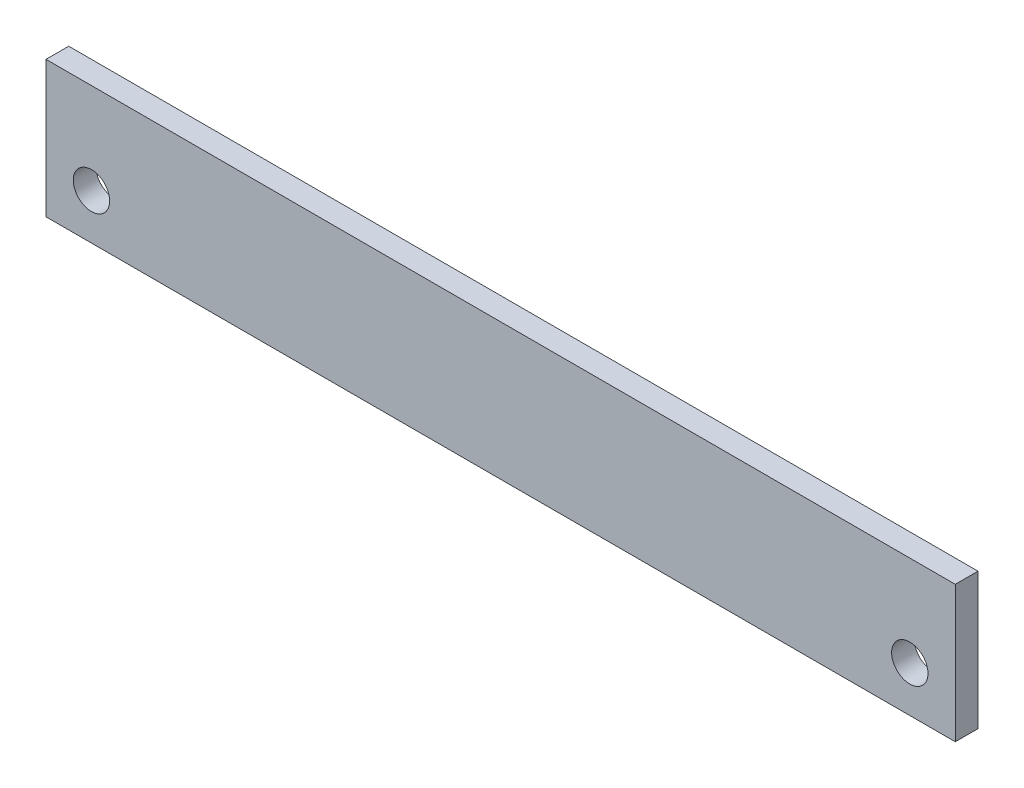
ISO-10303-21;
HEADER;
FILE_DESCRIPTION(('STEP AP214'),'2;1');
FILE_NAME('part.step','',(''),(''),'','','');
FILE_SCHEMA(('AUTOMOTIVE_DESIGN { 1 0 10303 214 1 1 1 1 }'));
ENDSEC;
DATA;
#1=APPLICATION_CONTEXT('core data for automotive mechanical design processes');
#2=APPLICATION_PROTOCOL_DEFINITION('international standard','automotive_design',2000,#1);
#3=PRODUCT_CONTEXT('',#1,'mechanical');
#4=PRODUCT('Part','Part','',(#3));
#5=PRODUCT_RELATED_PRODUCT_CATEGORY('part','',(#4));
#6=PRODUCT_DEFINITION_FORMATION('','',#4);
#7=PRODUCT_DEFINITION_CONTEXT('part definition',#1,'design');
#8=PRODUCT_DEFINITION('design','',#6,#7);
#9=PRODUCT_DEFINITION_SHAPE('','',#8);
#10=(LENGTH_UNIT() NAMED_UNIT(*) SI_UNIT(.MILLI.,.METRE.));
#11=(NAMED_UNIT(*) PLANE_ANGLE_UNIT() SI_UNIT($,.RADIAN.));
#12=(NAMED_UNIT(*) SI_UNIT($,.STERADIAN.) SOLID_ANGLE_UNIT());
#13=UNCERTAINTY_MEASURE_WITH_UNIT(LENGTH_MEASURE(1.E-05),#10,'distance_accuracy_value','');
#14=(GEOMETRIC_REPRESENTATION_CONTEXT(3) GLOBAL_UNCERTAINTY_ASSIGNED_CONTEXT((#13)) GLOBAL_UNIT_ASSIGNED_CONTEXT((#10,
#11,#12)) REPRESENTATION_CONTEXT('',''));
#15=CARTESIAN_POINT('',(0.,0.,0.));
#16=DIRECTION('',(0.,0.,1.));
#17=DIRECTION('',(1.,0.,0.));
#18=AXIS2_PLACEMENT_3D('',#15,#16,#17);
#19=CARTESIAN_POINT('',(100.,-15.,5.));
#20=DIRECTION('',(-1.,0.,0.));
#21=DIRECTION('',(0.,0.,1.));
#22=AXIS2_PLACEMENT_3D('',#19,#20,#21);
#23=PLANE('',#22);
#24=DIRECTION('',(0.,1.,0.));
#25=VECTOR('',#24,1.);
#26=CARTESIAN_POINT('',(100.,-15.,0.));
#27=LINE('',#26,#25);
#28=CARTESIAN_POINT('',(100.,-15.,0.));
#29=VERTEX_POINT('',#28);
#30=CARTESIAN_POINT('',(100.,15.,0.));
#31=VERTEX_POINT('',#30);
#32=EDGE_CURVE('E96',#29,#31,#27,.T.);
#33=ORIENTED_EDGE('',*,*,#32,.T.);
#34=DIRECTION('',(0.,0.,-1.));
#35=VECTOR('',#34,1.);
#36=CARTESIAN_POINT('',(100.,15.,5.));
#37=LINE('',#36,#35);
#38=CARTESIAN_POINT('',(100.,15.,5.));
#39=VERTEX_POINT('',#38);
#40=EDGE_CURVE('E11',#39,#31,#37,.T.);
#41=ORIENTED_EDGE('',*,*,#40,.F.);
#42=DIRECTION('',(0.,1.,0.));
#43=VECTOR('',#42,1.);
#44=CARTESIAN_POINT('',(100.,-15.,5.));
#45=LINE('',#44,#43);
#46=CARTESIAN_POINT('',(100.,-15.,5.));
#47=VERTEX_POINT('',#46);
#48=EDGE_CURVE('E84',#47,#39,#45,.T.);
#49=ORIENTED_EDGE('',*,*,#48,.F.);
#50=DIRECTION('',(0.,0.,-1.));
#51=VECTOR('',#50,1.);
#52=CARTESIAN_POINT('',(100.,-15.,5.));
#53=LINE('',#52,#51);
#54=EDGE_CURVE('E92',#47,#29,#53,.T.);
#55=ORIENTED_EDGE('',*,*,#54,.T.);
#56=EDGE_LOOP('',(#33,#41,#49,#55));
#57=FACE_BOUND('',#56,.T.);
#58=ADVANCED_FACE('F33',(#57),#23,.F.);
#59=CARTESIAN_POINT('',(-100.,15.,5.));
#60=DIRECTION('',(0.,-1.,0.));
#61=DIRECTION('',(0.,0.,-1.));
#62=AXIS2_PLACEMENT_3D('',#59,#60,#61);
#63=PLANE('',#62);
#64=DIRECTION('',(-1.,0.,0.));
#65=VECTOR('',#64,1.);
#66=CARTESIAN_POINT('',(-100.,15.,0.));
#67=LINE('',#66,#65);
#68=CARTESIAN_POINT('',(-100.,15.,0.));
#69=VERTEX_POINT('',#68);
#70=EDGE_CURVE('E88',#31,#69,#67,.T.);
#71=ORIENTED_EDGE('',*,*,#70,.T.);
#72=DIRECTION('',(0.,0.,-1.));
#73=VECTOR('',#72,1.);
#74=CARTESIAN_POINT('',(-100.,15.,5.));
#75=LINE('',#74,#73);
#76=CARTESIAN_POINT('',(-100.,15.,5.));
#77=VERTEX_POINT('',#76);
#78=EDGE_CURVE('E41',#77,#69,#75,.T.);
#79=ORIENTED_EDGE('',*,*,#78,.F.);
#80=DIRECTION('',(-1.,0.,0.));
#81=VECTOR('',#80,1.);
#82=CARTESIAN_POINT('',(-100.,15.,5.));
#83=LINE('',#82,#81);
#84=EDGE_CURVE('E79',#39,#77,#83,.T.);
#85=ORIENTED_EDGE('',*,*,#84,.F.);
#86=ORIENTED_EDGE('',*,*,#40,.T.);
#87=EDGE_LOOP('',(#71,#79,#85,#86));
#88=FACE_BOUND('',#87,.T.);
#89=ADVANCED_FACE('F87',(#88),#63,.F.);
#90=CARTESIAN_POINT('',(-100.,-15.,5.));
#91=DIRECTION('',(1.,0.,0.));
#92=DIRECTION('',(0.,0.,-1.));
#93=AXIS2_PLACEMENT_3D('',#90,#91,#92);
#94=PLANE('',#93);
#95=DIRECTION('',(0.,-1.,0.));
#96=VECTOR('',#95,1.);
#97=CARTESIAN_POINT('',(-100.,-15.,0.));
#98=LINE('',#97,#96);
#99=CARTESIAN_POINT('',(-100.,-15.,0.));
#100=VERTEX_POINT('',#99);
#101=EDGE_CURVE('E66',#69,#100,#98,.T.);
#102=ORIENTED_EDGE('',*,*,#101,.T.);
#103=DIRECTION('',(0.,0.,-1.));
#104=VECTOR('',#103,1.);
#105=CARTESIAN_POINT('',(-100.,-15.,5.));
#106=LINE('',#105,#104);
#107=CARTESIAN_POINT('',(-100.,-15.,5.));
#108=VERTEX_POINT('',#107);
#109=EDGE_CURVE('E89',#108,#100,#106,.T.);
#110=ORIENTED_EDGE('',*,*,#109,.F.);
#111=DIRECTION('',(0.,-1.,0.));
#112=VECTOR('',#111,1.);
#113=CARTESIAN_POINT('',(-100.,-15.,5.));
#114=LINE('',#113,#112);
#115=EDGE_CURVE('E82',#77,#108,#114,.T.);
#116=ORIENTED_EDGE('',*,*,#115,.F.);
#117=ORIENTED_EDGE('',*,*,#78,.T.);
#118=EDGE_LOOP('',(#102,#110,#116,#117));
#119=FACE_BOUND('',#118,.T.);
#120=ADVANCED_FACE('F90',(#119),#94,.F.);
#121=CARTESIAN_POINT('',(-100.,-15.,5.));
#122=DIRECTION('',(0.,1.,0.));
#123=DIRECTION('',(0.,0.,1.));
#124=AXIS2_PLACEMENT_3D('',#121,#122,#123);
#125=PLANE('',#124);
#126=DIRECTION('',(1.,0.,0.));
#127=VECTOR('',#126,1.);
#128=CARTESIAN_POINT('',(-100.,-15.,0.));
#129=LINE('',#128,#127);
#130=EDGE_CURVE('E72',#100,#29,#129,.T.);
#131=ORIENTED_EDGE('',*,*,#130,.T.);
#132=ORIENTED_EDGE('',*,*,#54,.F.);
#133=DIRECTION('',(1.,0.,0.));
#134=VECTOR('',#133,1.);
#135=CARTESIAN_POINT('',(-100.,-15.,5.));
#136=LINE('',#135,#134);
#137=EDGE_CURVE('E49',#108,#47,#136,.T.);
#138=ORIENTED_EDGE('',*,*,#137,.F.);
#139=ORIENTED_EDGE('',*,*,#109,.T.);
#140=EDGE_LOOP('',(#131,#132,#138,#139));
#141=FACE_BOUND('',#140,.T.);
#142=ADVANCED_FACE('F104',(#141),#125,.F.);
#143=CARTESIAN_POINT('',(0.,0.,5.));
#144=DIRECTION('',(0.,0.,-1.));
#145=DIRECTION('',(-1.,0.,0.));
#146=AXIS2_PLACEMENT_3D('',#143,#144,#145);
#147=PLANE('',#146);
#148=CARTESIAN_POINT('',(90.,-4.99999999999998,5.));
#149=DIRECTION('',(0.,0.,1.));
#150=DIRECTION('',(-1.,0.,0.));
#151=AXIS2_PLACEMENT_3D('',#148,#149,#150);
#152=CIRCLE('',#151,4.00000000000001);
#153=CARTESIAN_POINT('',(86.,-4.99999999999998,5.));
#154=VERTEX_POINT('',#153);
#155=EDGE_CURVE('E116',#154,#154,#152,.T.);
#156=ORIENTED_EDGE('',*,*,#155,.F.);
#157=EDGE_LOOP('',(#156));
#158=FACE_BOUND('',#157,.T.);
#159=CARTESIAN_POINT('',(-90.,-4.99999999999999,5.));
#160=DIRECTION('',(0.,0.,1.));
#161=DIRECTION('',(1.,0.,0.));
#162=AXIS2_PLACEMENT_3D('',#159,#160,#161);
#163=CIRCLE('',#162,4.00000000000001);
#164=CARTESIAN_POINT('',(-86.,-4.99999999999999,5.));
#165=VERTEX_POINT('',#164);
#166=EDGE_CURVE('E110',#165,#165,#163,.T.);
#167=ORIENTED_EDGE('',*,*,#166,.F.);
#168=EDGE_LOOP('',(#167));
#169=FACE_BOUND('',#168,.T.);
#170=ORIENTED_EDGE('',*,*,#48,.T.);
#171=ORIENTED_EDGE('',*,*,#84,.T.);
#172=ORIENTED_EDGE('',*,*,#115,.T.);
#173=ORIENTED_EDGE('',*,*,#137,.T.);
#174=EDGE_LOOP('',(#170,#171,#172,#173));
#175=FACE_BOUND('',#174,.T.);
#176=ADVANCED_FACE('F80',(#158,#169,#175),#147,.F.);
#177=CARTESIAN_POINT('',(0.,0.,0.));
#178=DIRECTION('',(0.,0.,-1.));
#179=DIRECTION('',(-1.,0.,0.));
#180=AXIS2_PLACEMENT_3D('',#177,#178,#179);
#181=PLANE('',#180);
#182=CARTESIAN_POINT('',(90.,-4.99999999999998,0.));
#183=DIRECTION('',(0.,0.,1.));
#184=DIRECTION('',(-1.,0.,0.));
#185=AXIS2_PLACEMENT_3D('',#182,#183,#184);
#186=CIRCLE('',#185,4.00000000000001);
#187=CARTESIAN_POINT('',(86.,-4.99999999999998,0.));
#188=VERTEX_POINT('',#187);
#189=EDGE_CURVE('E99',#188,#188,#186,.T.);
#190=ORIENTED_EDGE('',*,*,#189,.T.);
#191=EDGE_LOOP('',(#190));
#192=FACE_BOUND('',#191,.T.);
#193=CARTESIAN_POINT('',(-90.,-4.99999999999999,0.));
#194=DIRECTION('',(0.,0.,1.));
#195=DIRECTION('',(1.,0.,0.));
#196=AXIS2_PLACEMENT_3D('',#193,#194,#195);
#197=CIRCLE('',#196,4.00000000000001);
#198=CARTESIAN_POINT('',(-86.,-4.99999999999999,0.));
#199=VERTEX_POINT('',#198);
#200=EDGE_CURVE('E113',#199,#199,#197,.T.);
#201=ORIENTED_EDGE('',*,*,#200,.T.);
#202=EDGE_LOOP('',(#201));
#203=FACE_BOUND('',#202,.T.);
#204=ORIENTED_EDGE('',*,*,#32,.F.);
#205=ORIENTED_EDGE('',*,*,#130,.F.);
#206=ORIENTED_EDGE('',*,*,#101,.F.);
#207=ORIENTED_EDGE('',*,*,#70,.F.);
#208=EDGE_LOOP('',(#204,#205,#206,#207));
#209=FACE_BOUND('',#208,.T.);
#210=ADVANCED_FACE('F107',(#192,#203,#209),#181,.T.);
#211=CARTESIAN_POINT('',(-90.,-4.99999999999999,0.));
#212=DIRECTION('',(0.,0.,1.));
#213=DIRECTION('',(1.,0.,0.));
#214=AXIS2_PLACEMENT_3D('',#211,#212,#213);
#215=CYLINDRICAL_SURFACE('',#214,4.00000000000001);
#216=ORIENTED_EDGE('',*,*,#200,.F.);
#217=EDGE_LOOP('',(#216));
#218=FACE_BOUND('',#217,.T.);
#219=ORIENTED_EDGE('',*,*,#166,.T.);
#220=EDGE_LOOP('',(#219));
#221=FACE_BOUND('',#220,.T.);
#222=ADVANCED_FACE('F127',(#218,#221),#215,.F.);
#223=CARTESIAN_POINT('',(90.,-4.99999999999998,0.));
#224=DIRECTION('',(0.,0.,1.));
#225=DIRECTION('',(1.,0.,0.));
#226=AXIS2_PLACEMENT_3D('',#223,#224,#225);
#227=CYLINDRICAL_SURFACE('',#226,4.00000000000001);
#228=ORIENTED_EDGE('',*,*,#189,.F.);
#229=EDGE_LOOP('',(#228));
#230=FACE_BOUND('',#229,.T.);
#231=ORIENTED_EDGE('',*,*,#155,.T.);
#232=EDGE_LOOP('',(#231));
#233=FACE_BOUND('',#232,.T.);
#234=ADVANCED_FACE('F124',(#230,#233),#227,.F.);
#235=CLOSED_SHELL('',(#58,#89,#120,#142,#176,#210,#222,#234));
#236=MANIFOLD_SOLID_BREP('B2',#235);
#237=ADVANCED_BREP_SHAPE_REPRESENTATION('',(#18,#236),#14);
#238=SHAPE_DEFINITION_REPRESENTATION(#9,#237);
ENDSEC;
END-ISO-10303-21;
